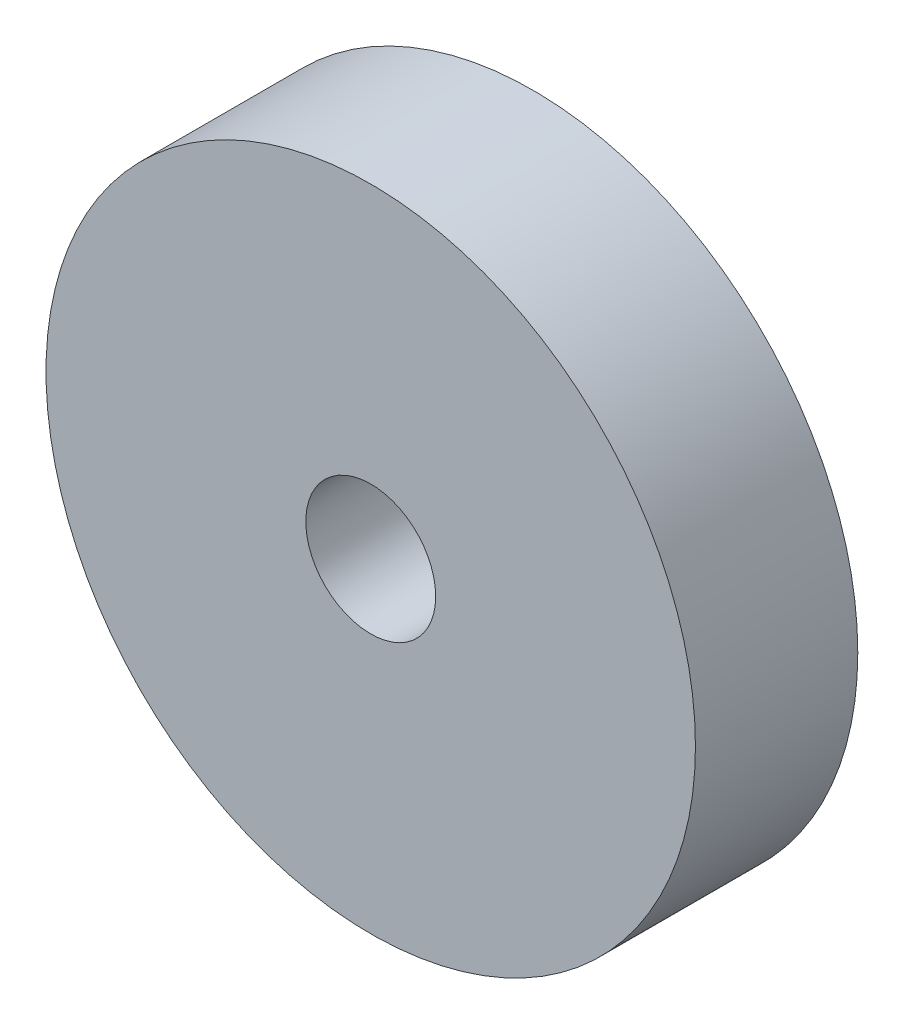
ISO-10303-21;
HEADER;
FILE_DESCRIPTION(('STEP AP214'),'2;1');
FILE_NAME('part.step','',(''),(''),'','','');
FILE_SCHEMA(('AUTOMOTIVE_DESIGN { 1 0 10303 214 1 1 1 1 }'));
ENDSEC;
DATA;
#1=APPLICATION_CONTEXT('core data for automotive mechanical design processes');
#2=APPLICATION_PROTOCOL_DEFINITION('international standard','automotive_design',2000,#1);
#3=PRODUCT_CONTEXT('',#1,'mechanical');
#4=PRODUCT('Part','Part','',(#3));
#5=PRODUCT_RELATED_PRODUCT_CATEGORY('part','',(#4));
#6=PRODUCT_DEFINITION_FORMATION('','',#4);
#7=PRODUCT_DEFINITION_CONTEXT('part definition',#1,'design');
#8=PRODUCT_DEFINITION('design','',#6,#7);
#9=PRODUCT_DEFINITION_SHAPE('','',#8);
#10=(LENGTH_UNIT() NAMED_UNIT(*) SI_UNIT(.MILLI.,.METRE.));
#11=(NAMED_UNIT(*) PLANE_ANGLE_UNIT() SI_UNIT($,.RADIAN.));
#12=(NAMED_UNIT(*) SI_UNIT($,.STERADIAN.) SOLID_ANGLE_UNIT());
#13=UNCERTAINTY_MEASURE_WITH_UNIT(LENGTH_MEASURE(1.E-05),#10,'distance_accuracy_value','');
#14=(GEOMETRIC_REPRESENTATION_CONTEXT(3) GLOBAL_UNCERTAINTY_ASSIGNED_CONTEXT((#13)) GLOBAL_UNIT_ASSIGNED_CONTEXT((#10,
#11,#12)) REPRESENTATION_CONTEXT('',''));
#15=CARTESIAN_POINT('',(0.,0.,0.));
#16=DIRECTION('',(0.,0.,1.));
#17=DIRECTION('',(1.,0.,0.));
#18=AXIS2_PLACEMENT_3D('',#15,#16,#17);
#19=CARTESIAN_POINT('',(0.,0.,0.25));
#20=DIRECTION('',(0.,0.,1.));
#21=DIRECTION('',(1.,0.,0.));
#22=AXIS2_PLACEMENT_3D('',#19,#20,#21);
#23=PLANE('',#22);
#24=CARTESIAN_POINT('',(0.,0.,0.25));
#25=DIRECTION('',(0.,0.,1.));
#26=DIRECTION('',(1.,0.,0.));
#27=AXIS2_PLACEMENT_3D('',#24,#25,#26);
#28=CIRCLE('',#27,0.5);
#29=CARTESIAN_POINT('',(0.500000000000007,0.,0.25));
#30=VERTEX_POINT('',#29);
#31=EDGE_CURVE('E10',#30,#30,#28,.T.);
#32=ORIENTED_EDGE('',*,*,#31,.T.);
#33=EDGE_LOOP('',(#32));
#34=FACE_BOUND('',#33,.T.);
#35=CARTESIAN_POINT('',(0.,0.,0.25));
#36=DIRECTION('',(0.,0.,1.));
#37=DIRECTION('',(1.,0.,0.));
#38=AXIS2_PLACEMENT_3D('',#35,#36,#37);
#39=CIRCLE('',#38,0.1);
#40=CARTESIAN_POINT('',(0.100000000000007,0.,0.25));
#41=VERTEX_POINT('',#40);
#42=EDGE_CURVE('E43',#41,#41,#39,.T.);
#43=ORIENTED_EDGE('',*,*,#42,.F.);
#44=EDGE_LOOP('',(#43));
#45=FACE_BOUND('',#44,.T.);
#46=ADVANCED_FACE('F32',(#34,#45),#23,.T.);
#47=CARTESIAN_POINT('',(0.,0.,0.));
#48=DIRECTION('',(0.,0.,1.));
#49=DIRECTION('',(1.,0.,0.));
#50=AXIS2_PLACEMENT_3D('',#47,#48,#49);
#51=PLANE('',#50);
#52=CARTESIAN_POINT('',(0.,0.,0.));
#53=DIRECTION('',(0.,0.,1.));
#54=DIRECTION('',(1.,0.,0.));
#55=AXIS2_PLACEMENT_3D('',#52,#53,#54);
#56=CIRCLE('',#55,0.5);
#57=CARTESIAN_POINT('',(0.5,0.,0.));
#58=VERTEX_POINT('',#57);
#59=EDGE_CURVE('E36',#58,#58,#56,.T.);
#60=ORIENTED_EDGE('',*,*,#59,.F.);
#61=EDGE_LOOP('',(#60));
#62=FACE_BOUND('',#61,.T.);
#63=CARTESIAN_POINT('',(0.,0.,0.));
#64=DIRECTION('',(0.,0.,1.));
#65=DIRECTION('',(1.,0.,0.));
#66=AXIS2_PLACEMENT_3D('',#63,#64,#65);
#67=CIRCLE('',#66,0.1);
#68=CARTESIAN_POINT('',(0.1,0.,0.));
#69=VERTEX_POINT('',#68);
#70=EDGE_CURVE('E45',#69,#69,#67,.T.);
#71=ORIENTED_EDGE('',*,*,#70,.T.);
#72=EDGE_LOOP('',(#71));
#73=FACE_BOUND('',#72,.T.);
#74=ADVANCED_FACE('F55',(#62,#73),#51,.F.);
#75=CARTESIAN_POINT('',(0.,0.,0.25));
#76=DIRECTION('',(0.,0.,-1.));
#77=DIRECTION('',(-1.,0.,0.));
#78=AXIS2_PLACEMENT_3D('',#75,#76,#77);
#79=CYLINDRICAL_SURFACE('',#78,0.5);
#80=ORIENTED_EDGE('',*,*,#31,.F.);
#81=EDGE_LOOP('',(#80));
#82=FACE_BOUND('',#81,.T.);
#83=ORIENTED_EDGE('',*,*,#59,.T.);
#84=EDGE_LOOP('',(#83));
#85=FACE_BOUND('',#84,.T.);
#86=ADVANCED_FACE('F34',(#82,#85),#79,.T.);
#87=CARTESIAN_POINT('',(0.,0.,0.25));
#88=DIRECTION('',(0.,0.,-1.));
#89=DIRECTION('',(-1.,0.,0.));
#90=AXIS2_PLACEMENT_3D('',#87,#88,#89);
#91=CYLINDRICAL_SURFACE('',#90,0.1);
#92=ORIENTED_EDGE('',*,*,#42,.T.);
#93=EDGE_LOOP('',(#92));
#94=FACE_BOUND('',#93,.T.);
#95=ORIENTED_EDGE('',*,*,#70,.F.);
#96=EDGE_LOOP('',(#95));
#97=FACE_BOUND('',#96,.T.);
#98=ADVANCED_FACE('F51',(#94,#97),#91,.F.);
#99=CLOSED_SHELL('',(#46,#74,#86,#98));
#100=MANIFOLD_SOLID_BREP('B2',#99);
#101=ADVANCED_BREP_SHAPE_REPRESENTATION('',(#18,#100),#14);
#102=SHAPE_DEFINITION_REPRESENTATION(#9,#101);
ENDSEC;
END-ISO-10303-21;
